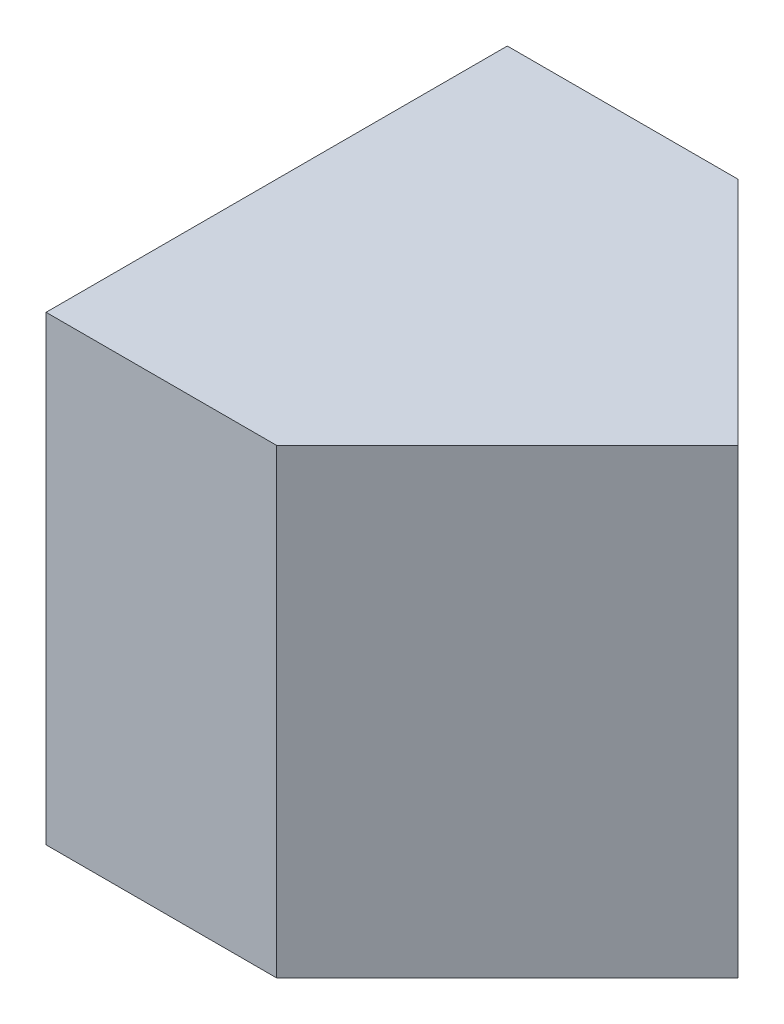
ISO-10303-21;
HEADER;
FILE_DESCRIPTION(('STEP AP214'),'2;1');
FILE_NAME('part.step','',(''),(''),'','','');
FILE_SCHEMA(('AUTOMOTIVE_DESIGN { 1 0 10303 214 1 1 1 1 }'));
ENDSEC;
DATA;
#1=APPLICATION_CONTEXT('core data for automotive mechanical design processes');
#2=APPLICATION_PROTOCOL_DEFINITION('international standard','automotive_design',2000,#1);
#3=PRODUCT_CONTEXT('',#1,'mechanical');
#4=PRODUCT('Part','Part','',(#3));
#5=PRODUCT_RELATED_PRODUCT_CATEGORY('part','',(#4));
#6=PRODUCT_DEFINITION_FORMATION('','',#4);
#7=PRODUCT_DEFINITION_CONTEXT('part definition',#1,'design');
#8=PRODUCT_DEFINITION('design','',#6,#7);
#9=PRODUCT_DEFINITION_SHAPE('','',#8);
#10=(LENGTH_UNIT() NAMED_UNIT(*) SI_UNIT(.MILLI.,.METRE.));
#11=(NAMED_UNIT(*) PLANE_ANGLE_UNIT() SI_UNIT($,.RADIAN.));
#12=(NAMED_UNIT(*) SI_UNIT($,.STERADIAN.) SOLID_ANGLE_UNIT());
#13=UNCERTAINTY_MEASURE_WITH_UNIT(LENGTH_MEASURE(1.E-05),#10,'distance_accuracy_value','');
#14=(GEOMETRIC_REPRESENTATION_CONTEXT(3) GLOBAL_UNCERTAINTY_ASSIGNED_CONTEXT((#13)) GLOBAL_UNIT_ASSIGNED_CONTEXT((#10,
#11,#12)) REPRESENTATION_CONTEXT('',''));
#15=CARTESIAN_POINT('',(0.,0.,0.));
#16=DIRECTION('',(0.,0.,1.));
#17=DIRECTION('',(1.,0.,0.));
#18=AXIS2_PLACEMENT_3D('',#15,#16,#17);
#19=CARTESIAN_POINT('',(0.,0.,20.));
#20=DIRECTION('',(1.,0.,0.));
#21=DIRECTION('',(0.,1.,0.));
#22=AXIS2_PLACEMENT_3D('',#19,#20,#21);
#23=PLANE('',#22);
#24=DIRECTION('',(0.,-1.,0.));
#25=VECTOR('',#24,1.);
#26=CARTESIAN_POINT('',(0.,0.,0.));
#27=LINE('',#26,#25);
#28=CARTESIAN_POINT('',(0.,20.,0.));
#29=VERTEX_POINT('',#28);
#30=CARTESIAN_POINT('',(0.,0.,0.));
#31=VERTEX_POINT('',#30);
#32=EDGE_CURVE('E86',#29,#31,#27,.T.);
#33=ORIENTED_EDGE('',*,*,#32,.T.);
#34=DIRECTION('',(0.,0.,-1.));
#35=VECTOR('',#34,1.);
#36=CARTESIAN_POINT('',(0.,0.,20.));
#37=LINE('',#36,#35);
#38=CARTESIAN_POINT('',(0.,0.,20.));
#39=VERTEX_POINT('',#38);
#40=EDGE_CURVE('E11',#39,#31,#37,.T.);
#41=ORIENTED_EDGE('',*,*,#40,.F.);
#42=DIRECTION('',(0.,-1.,0.));
#43=VECTOR('',#42,1.);
#44=CARTESIAN_POINT('',(0.,0.,20.));
#45=LINE('',#44,#43);
#46=CARTESIAN_POINT('',(0.,20.,20.));
#47=VERTEX_POINT('',#46);
#48=EDGE_CURVE('E80',#47,#39,#45,.T.);
#49=ORIENTED_EDGE('',*,*,#48,.F.);
#50=DIRECTION('',(0.,0.,-1.));
#51=VECTOR('',#50,1.);
#52=CARTESIAN_POINT('',(0.,20.,20.));
#53=LINE('',#52,#51);
#54=EDGE_CURVE('E40',#47,#29,#53,.T.);
#55=ORIENTED_EDGE('',*,*,#54,.T.);
#56=EDGE_LOOP('',(#33,#41,#49,#55));
#57=FACE_BOUND('',#56,.T.);
#58=ADVANCED_FACE('F33',(#57),#23,.F.);
#59=CARTESIAN_POINT('',(0.,0.,20.));
#60=DIRECTION('',(0.,1.,0.));
#61=DIRECTION('',(0.,0.,1.));
#62=AXIS2_PLACEMENT_3D('',#59,#60,#61);
#63=PLANE('',#62);
#64=DIRECTION('',(0.707106781186548,0.,0.707106781186547));
#65=VECTOR('',#64,1.);
#66=CARTESIAN_POINT('',(9.99999999999999,0.,0.));
#67=LINE('',#66,#65);
#68=CARTESIAN_POINT('',(9.99999999999999,0.,0.));
#69=VERTEX_POINT('',#68);
#70=CARTESIAN_POINT('',(20.,0.,10.));
#71=VERTEX_POINT('',#70);
#72=EDGE_CURVE('E47',#69,#71,#67,.T.);
#73=ORIENTED_EDGE('',*,*,#72,.T.);
#74=DIRECTION('',(-0.707106781186548,0.,0.707106781186547));
#75=VECTOR('',#74,1.);
#76=CARTESIAN_POINT('',(9.99999999999999,0.,20.));
#77=LINE('',#76,#75);
#78=CARTESIAN_POINT('',(9.99999999999999,0.,20.));
#79=VERTEX_POINT('',#78);
#80=EDGE_CURVE('E106',#71,#79,#77,.T.);
#81=ORIENTED_EDGE('',*,*,#80,.T.);
#82=DIRECTION('',(1.,0.,0.));
#83=VECTOR('',#82,1.);
#84=CARTESIAN_POINT('',(0.,0.,20.));
#85=LINE('',#84,#83);
#86=EDGE_CURVE('E97',#39,#79,#85,.T.);
#87=ORIENTED_EDGE('',*,*,#86,.F.);
#88=ORIENTED_EDGE('',*,*,#40,.T.);
#89=DIRECTION('',(1.,0.,0.));
#90=VECTOR('',#89,1.);
#91=CARTESIAN_POINT('',(0.,0.,0.));
#92=LINE('',#91,#90);
#93=EDGE_CURVE('E81',#31,#69,#92,.T.);
#94=ORIENTED_EDGE('',*,*,#93,.T.);
#95=EDGE_LOOP('',(#73,#81,#87,#88,#94));
#96=FACE_BOUND('',#95,.T.);
#97=ADVANCED_FACE('F114',(#96),#63,.F.);
#98=CARTESIAN_POINT('',(0.,20.,20.));
#99=DIRECTION('',(0.,-1.,0.));
#100=DIRECTION('',(0.,0.,-1.));
#101=AXIS2_PLACEMENT_3D('',#98,#99,#100);
#102=PLANE('',#101);
#103=DIRECTION('',(-1.,0.,0.));
#104=VECTOR('',#103,1.);
#105=CARTESIAN_POINT('',(0.,20.,20.));
#106=LINE('',#105,#104);
#107=CARTESIAN_POINT('',(9.99999999999999,20.,20.));
#108=VERTEX_POINT('',#107);
#109=EDGE_CURVE('E56',#108,#47,#106,.T.);
#110=ORIENTED_EDGE('',*,*,#109,.F.);
#111=DIRECTION('',(-0.707106781186548,0.,0.707106781186547));
#112=VECTOR('',#111,1.);
#113=CARTESIAN_POINT('',(9.99999999999999,20.,20.));
#114=LINE('',#113,#112);
#115=CARTESIAN_POINT('',(20.,20.,10.));
#116=VERTEX_POINT('',#115);
#117=EDGE_CURVE('E107',#116,#108,#114,.T.);
#118=ORIENTED_EDGE('',*,*,#117,.F.);
#119=DIRECTION('',(0.707106781186548,0.,0.707106781186547));
#120=VECTOR('',#119,1.);
#121=CARTESIAN_POINT('',(9.99999999999999,20.,0.));
#122=LINE('',#121,#120);
#123=CARTESIAN_POINT('',(9.99999999999999,20.,0.));
#124=VERTEX_POINT('',#123);
#125=EDGE_CURVE('E77',#124,#116,#122,.T.);
#126=ORIENTED_EDGE('',*,*,#125,.F.);
#127=DIRECTION('',(-1.,0.,0.));
#128=VECTOR('',#127,1.);
#129=CARTESIAN_POINT('',(0.,20.,0.));
#130=LINE('',#129,#128);
#131=EDGE_CURVE('E70',#124,#29,#130,.T.);
#132=ORIENTED_EDGE('',*,*,#131,.T.);
#133=ORIENTED_EDGE('',*,*,#54,.F.);
#134=EDGE_LOOP('',(#110,#118,#126,#132,#133));
#135=FACE_BOUND('',#134,.T.);
#136=ADVANCED_FACE('F72',(#135),#102,.F.);
#137=CARTESIAN_POINT('',(0.,0.,20.));
#138=DIRECTION('',(0.,0.,-1.));
#139=DIRECTION('',(-1.,0.,0.));
#140=AXIS2_PLACEMENT_3D('',#137,#138,#139);
#141=PLANE('',#140);
#142=ORIENTED_EDGE('',*,*,#86,.T.);
#143=DIRECTION('',(0.,1.,0.));
#144=VECTOR('',#143,1.);
#145=CARTESIAN_POINT('',(9.99999999999999,0.,20.));
#146=LINE('',#145,#144);
#147=EDGE_CURVE('E103',#79,#108,#146,.T.);
#148=ORIENTED_EDGE('',*,*,#147,.T.);
#149=ORIENTED_EDGE('',*,*,#109,.T.);
#150=ORIENTED_EDGE('',*,*,#48,.T.);
#151=EDGE_LOOP('',(#142,#148,#149,#150));
#152=FACE_BOUND('',#151,.T.);
#153=ADVANCED_FACE('F119',(#152),#141,.F.);
#154=CARTESIAN_POINT('',(0.,0.,0.));
#155=DIRECTION('',(0.,0.,-1.));
#156=DIRECTION('',(-1.,0.,0.));
#157=AXIS2_PLACEMENT_3D('',#154,#155,#156);
#158=PLANE('',#157);
#159=DIRECTION('',(0.,1.,0.));
#160=VECTOR('',#159,1.);
#161=CARTESIAN_POINT('',(9.99999999999999,0.,0.));
#162=LINE('',#161,#160);
#163=EDGE_CURVE('E93',#69,#124,#162,.T.);
#164=ORIENTED_EDGE('',*,*,#163,.F.);
#165=ORIENTED_EDGE('',*,*,#93,.F.);
#166=ORIENTED_EDGE('',*,*,#32,.F.);
#167=ORIENTED_EDGE('',*,*,#131,.F.);
#168=EDGE_LOOP('',(#164,#165,#166,#167));
#169=FACE_BOUND('',#168,.T.);
#170=ADVANCED_FACE('F87',(#169),#158,.T.);
#171=CARTESIAN_POINT('',(9.99999999999999,0.,0.));
#172=DIRECTION('',(-0.707106781186547,0.,0.707106781186548));
#173=DIRECTION('',(0.707106781186548,0.,0.707106781186547));
#174=AXIS2_PLACEMENT_3D('',#171,#172,#173);
#175=PLANE('',#174);
#176=ORIENTED_EDGE('',*,*,#125,.T.);
#177=DIRECTION('',(0.,1.,0.));
#178=VECTOR('',#177,1.);
#179=CARTESIAN_POINT('',(20.,0.,10.));
#180=LINE('',#179,#178);
#181=EDGE_CURVE('E89',#71,#116,#180,.T.);
#182=ORIENTED_EDGE('',*,*,#181,.F.);
#183=ORIENTED_EDGE('',*,*,#72,.F.);
#184=ORIENTED_EDGE('',*,*,#163,.T.);
#185=EDGE_LOOP('',(#176,#182,#183,#184));
#186=FACE_BOUND('',#185,.T.);
#187=ADVANCED_FACE('F123',(#186),#175,.F.);
#188=CARTESIAN_POINT('',(9.99999999999999,0.,20.));
#189=DIRECTION('',(-0.707106781186547,0.,-0.707106781186548));
#190=DIRECTION('',(-0.707106781186548,0.,0.707106781186547));
#191=AXIS2_PLACEMENT_3D('',#188,#189,#190);
#192=PLANE('',#191);
#193=ORIENTED_EDGE('',*,*,#117,.T.);
#194=ORIENTED_EDGE('',*,*,#147,.F.);
#195=ORIENTED_EDGE('',*,*,#80,.F.);
#196=ORIENTED_EDGE('',*,*,#181,.T.);
#197=EDGE_LOOP('',(#193,#194,#195,#196));
#198=FACE_BOUND('',#197,.T.);
#199=ADVANCED_FACE('F125',(#198),#192,.F.);
#200=CLOSED_SHELL('',(#58,#97,#136,#153,#170,#187,#199));
#201=MANIFOLD_SOLID_BREP('B2',#200);
#202=ADVANCED_BREP_SHAPE_REPRESENTATION('',(#18,#201),#14);
#203=SHAPE_DEFINITION_REPRESENTATION(#9,#202);
ENDSEC;
END-ISO-10303-21;
